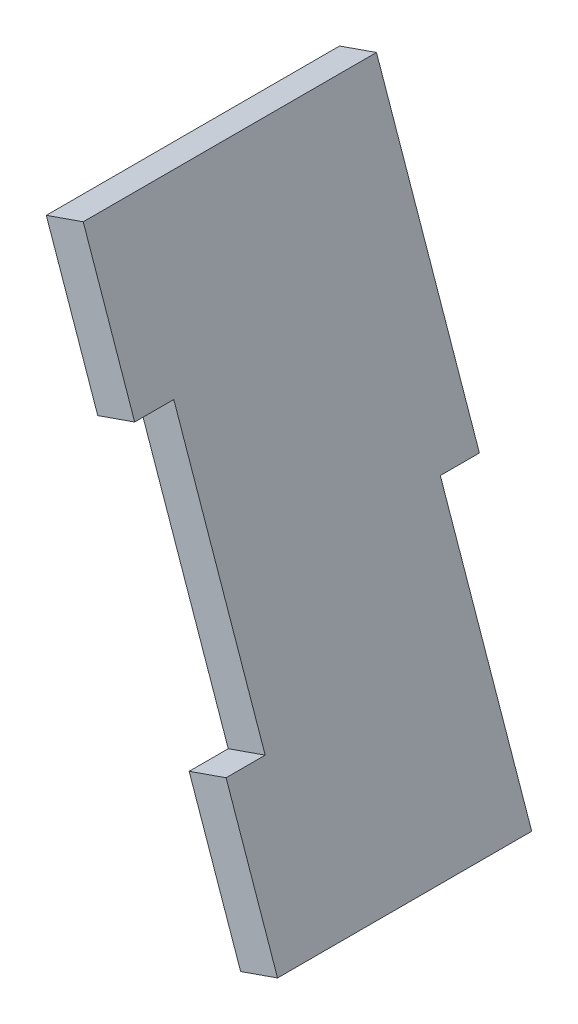
ISO-10303-21;
HEADER;
FILE_DESCRIPTION(('STEP AP214'),'2;1');
FILE_NAME('part.step','',(''),(''),'','','');
FILE_SCHEMA(('AUTOMOTIVE_DESIGN { 1 0 10303 214 1 1 1 1 }'));
ENDSEC;
DATA;
#1=APPLICATION_CONTEXT('core data for automotive mechanical design processes');
#2=APPLICATION_PROTOCOL_DEFINITION('international standard','automotive_design',2000,#1);
#3=PRODUCT_CONTEXT('',#1,'mechanical');
#4=PRODUCT('Part','Part','',(#3));
#5=PRODUCT_RELATED_PRODUCT_CATEGORY('part','',(#4));
#6=PRODUCT_DEFINITION_FORMATION('','',#4);
#7=PRODUCT_DEFINITION_CONTEXT('part definition',#1,'design');
#8=PRODUCT_DEFINITION('design','',#6,#7);
#9=PRODUCT_DEFINITION_SHAPE('','',#8);
#10=(LENGTH_UNIT() NAMED_UNIT(*) SI_UNIT(.MILLI.,.METRE.));
#11=(NAMED_UNIT(*) PLANE_ANGLE_UNIT() SI_UNIT($,.RADIAN.));
#12=(NAMED_UNIT(*) SI_UNIT($,.STERADIAN.) SOLID_ANGLE_UNIT());
#13=UNCERTAINTY_MEASURE_WITH_UNIT(LENGTH_MEASURE(1.E-05),#10,'distance_accuracy_value','');
#14=(GEOMETRIC_REPRESENTATION_CONTEXT(3) GLOBAL_UNCERTAINTY_ASSIGNED_CONTEXT((#13)) GLOBAL_UNIT_ASSIGNED_CONTEXT((#10,
#11,#12)) REPRESENTATION_CONTEXT('',''));
#15=CARTESIAN_POINT('',(0.,0.,0.));
#16=DIRECTION('',(0.,0.,1.));
#17=DIRECTION('',(1.,0.,0.));
#18=AXIS2_PLACEMENT_3D('',#15,#16,#17);
#19=CARTESIAN_POINT('',(-432.710213037798,335.493380268932,-23.8125));
#20=DIRECTION('',(0.,0.,1.));
#21=DIRECTION('',(0.999997615388015,0.00218385399765031,0.));
#22=AXIS2_PLACEMENT_3D('',#19,#20,#21);
#23=PLANE('',#22);
#24=DIRECTION('',(-0.944323729935791,-0.329017770158626,0.));
#25=VECTOR('',#24,1.);
#26=CARTESIAN_POINT('',(-314.308797668532,291.402504239534,-23.8124999999998));
#27=LINE('',#26,#25);
#28=CARTESIAN_POINT('',(-314.308797668532,291.402504239535,-23.8124999999998));
#29=VERTEX_POINT('',#28);
#30=CARTESIAN_POINT('',(-317.307025511078,290.357872819281,-23.8125));
#31=VERTEX_POINT('',#30);
#32=EDGE_CURVE('E120',#29,#31,#27,.T.);
#33=ORIENTED_EDGE('',*,*,#32,.T.);
#34=DIRECTION('',(0.329017770158626,-0.944323729935791,0.));
#35=VECTOR('',#34,1.);
#36=CARTESIAN_POINT('',(-309.885267674268,269.056463962983,-23.8125));
#37=LINE('',#36,#35);
#38=CARTESIAN_POINT('',(-325.664076873107,314.343695559649,-23.8125));
#39=VERTEX_POINT('',#38);
#40=EDGE_CURVE('E37',#39,#31,#37,.T.);
#41=ORIENTED_EDGE('',*,*,#40,.F.);
#42=DIRECTION('',(-0.944323729935799,-0.329017770158605,0.));
#43=VECTOR('',#42,1.);
#44=CARTESIAN_POINT('',(-325.664076873107,314.343695559649,-23.8125));
#45=LINE('',#44,#43);
#46=CARTESIAN_POINT('',(-322.665849030561,315.388326979903,-23.8125));
#47=VERTEX_POINT('',#46);
#48=EDGE_CURVE('E11',#47,#39,#45,.T.);
#49=ORIENTED_EDGE('',*,*,#48,.F.);
#50=DIRECTION('',(-0.329017770158627,0.944323729935791,0.));
#51=VECTOR('',#50,1.);
#52=CARTESIAN_POINT('',(-322.665849030561,315.388326979903,-23.8125));
#53=LINE('',#52,#51);
#54=EDGE_CURVE('E42',#29,#47,#53,.T.);
#55=ORIENTED_EDGE('',*,*,#54,.F.);
#56=EDGE_LOOP('',(#33,#41,#49,#55));
#57=FACE_BOUND('',#56,.T.);
#58=ADVANCED_FACE('F33',(#57),#23,.F.);
#59=CARTESIAN_POINT('',(0.,0.,0.));
#60=DIRECTION('',(0.,0.,-1.));
#61=DIRECTION('',(-1.,0.,0.));
#62=AXIS2_PLACEMENT_3D('',#59,#60,#61);
#63=PLANE('',#62);
#64=DIRECTION('',(0.329017770158627,-0.944323729935791,0.));
#65=VECTOR('',#64,1.);
#66=CARTESIAN_POINT('',(-322.665849030561,315.388326979903,0.));
#67=LINE('',#66,#65);
#68=CARTESIAN_POINT('',(-311.065565512737,282.094006753421,0.));
#69=VERTEX_POINT('',#68);
#70=CARTESIAN_POINT('',(-306.887039831722,270.101095383237,0.));
#71=VERTEX_POINT('',#70);
#72=EDGE_CURVE('E163',#69,#71,#67,.T.);
#73=ORIENTED_EDGE('',*,*,#72,.F.);
#74=DIRECTION('',(-0.944323729935791,-0.329017770158627,0.));
#75=VECTOR('',#74,1.);
#76=CARTESIAN_POINT('',(-311.065565512737,282.094006753421,0.));
#77=LINE('',#76,#75);
#78=CARTESIAN_POINT('',(-314.063793355283,281.049375333168,0.));
#79=VERTEX_POINT('',#78);
#80=EDGE_CURVE('E151',#69,#79,#77,.T.);
#81=ORIENTED_EDGE('',*,*,#80,.T.);
#82=DIRECTION('',(-0.329017770158626,0.944323729935791,0.));
#83=VECTOR('',#82,1.);
#84=CARTESIAN_POINT('',(-309.885267674268,269.056463962983,0.));
#85=LINE('',#84,#83);
#86=CARTESIAN_POINT('',(-309.885267674268,269.056463962983,0.));
#87=VERTEX_POINT('',#86);
#88=EDGE_CURVE('E171',#87,#79,#85,.T.);
#89=ORIENTED_EDGE('',*,*,#88,.F.);
#90=DIRECTION('',(-0.944323729935793,-0.329017770158621,0.));
#91=VECTOR('',#90,1.);
#92=CARTESIAN_POINT('',(-306.887039831722,270.101095383237,0.));
#93=LINE('',#92,#91);
#94=EDGE_CURVE('E167',#71,#87,#93,.T.);
#95=ORIENTED_EDGE('',*,*,#94,.F.);
#96=EDGE_LOOP('',(#73,#81,#89,#95));
#97=FACE_BOUND('',#96,.T.);
#98=ADVANCED_FACE('F207',(#97),#63,.F.);
#99=CARTESIAN_POINT('',(-321.485551192092,302.350784189465,0.));
#100=VERTEX_POINT('',#99);
#101=CARTESIAN_POINT('',(-325.664076873107,314.343695559649,0.));
#102=VERTEX_POINT('',#101);
#103=EDGE_CURVE('E170',#100,#102,#85,.T.);
#104=ORIENTED_EDGE('',*,*,#103,.F.);
#105=DIRECTION('',(-0.944323729935791,-0.329017770158627,0.));
#106=VECTOR('',#105,1.);
#107=CARTESIAN_POINT('',(-318.487323349546,303.395415609719,0.));
#108=LINE('',#107,#106);
#109=CARTESIAN_POINT('',(-318.487323349546,303.395415609719,0.));
#110=VERTEX_POINT('',#109);
#111=EDGE_CURVE('E149',#110,#100,#108,.T.);
#112=ORIENTED_EDGE('',*,*,#111,.F.);
#113=CARTESIAN_POINT('',(-322.665849030561,315.388326979903,0.));
#114=VERTEX_POINT('',#113);
#115=EDGE_CURVE('E164',#114,#110,#67,.T.);
#116=ORIENTED_EDGE('',*,*,#115,.F.);
#117=DIRECTION('',(0.944323729935799,0.329017770158605,0.));
#118=VECTOR('',#117,1.);
#119=CARTESIAN_POINT('',(-325.664076873107,314.343695559649,0.));
#120=LINE('',#119,#118);
#121=EDGE_CURVE('E159',#102,#114,#120,.T.);
#122=ORIENTED_EDGE('',*,*,#121,.F.);
#123=EDGE_LOOP('',(#104,#112,#116,#122));
#124=FACE_BOUND('',#123,.T.);
#125=ADVANCED_FACE('F192',(#124),#63,.F.);
#126=CARTESIAN_POINT('',(-309.885267674268,269.056463962983,-73.8046858961193));
#127=DIRECTION('',(0.944323729935791,0.329017770158626,0.));
#128=DIRECTION('',(-0.329017770158626,0.944323729935791,0.));
#129=AXIS2_PLACEMENT_3D('',#126,#127,#128);
#130=PLANE('',#129);
#131=DIRECTION('',(0.,0.,1.));
#132=VECTOR('',#131,1.);
#133=CARTESIAN_POINT('',(-317.307025511078,290.35787281928,-20.6375));
#134=LINE('',#133,#132);
#135=CARTESIAN_POINT('',(-317.307025511078,290.35787281928,-20.6375));
#136=VERTEX_POINT('',#135);
#137=EDGE_CURVE('E50',#31,#136,#134,.T.);
#138=ORIENTED_EDGE('',*,*,#137,.T.);
#139=DIRECTION('',(-0.329017770158626,0.944323729935792,0.));
#140=VECTOR('',#139,1.);
#141=CARTESIAN_POINT('',(-309.885267674268,269.056463962983,-20.6375));
#142=LINE('',#141,#140);
#143=CARTESIAN_POINT('',(-309.885267674268,269.056463962983,-20.6375));
#144=VERTEX_POINT('',#143);
#145=EDGE_CURVE('E118',#144,#136,#142,.T.);
#146=ORIENTED_EDGE('',*,*,#145,.F.);
#147=DIRECTION('',(0.,0.,1.));
#148=VECTOR('',#147,1.);
#149=CARTESIAN_POINT('',(-309.885267674268,269.056463962983,-73.8046858961193));
#150=LINE('',#149,#148);
#151=EDGE_CURVE('E176',#144,#87,#150,.T.);
#152=ORIENTED_EDGE('',*,*,#151,.T.);
#153=ORIENTED_EDGE('',*,*,#88,.T.);
#154=DIRECTION('',(0.,0.,1.));
#155=VECTOR('',#154,1.);
#156=CARTESIAN_POINT('',(-314.063793355283,281.049375333168,-3.17500000000004));
#157=LINE('',#156,#155);
#158=CARTESIAN_POINT('',(-314.063793355283,281.049375333168,-3.175));
#159=VERTEX_POINT('',#158);
#160=EDGE_CURVE('E132',#159,#79,#157,.T.);
#161=ORIENTED_EDGE('',*,*,#160,.F.);
#162=DIRECTION('',(0.329017770158626,-0.944323729935791,0.));
#163=VECTOR('',#162,1.);
#164=CARTESIAN_POINT('',(-309.885267674268,269.056463962983,-3.175));
#165=LINE('',#164,#163);
#166=CARTESIAN_POINT('',(-321.485551192092,302.350784189465,-3.17500000000004));
#167=VERTEX_POINT('',#166);
#168=EDGE_CURVE('E157',#167,#159,#165,.T.);
#169=ORIENTED_EDGE('',*,*,#168,.F.);
#170=DIRECTION('',(0.,0.,-1.));
#171=VECTOR('',#170,1.);
#172=CARTESIAN_POINT('',(-321.485551192092,302.350784189465,-3.17500000000004));
#173=LINE('',#172,#171);
#174=EDGE_CURVE('E134',#100,#167,#173,.T.);
#175=ORIENTED_EDGE('',*,*,#174,.F.);
#176=ORIENTED_EDGE('',*,*,#103,.T.);
#177=DIRECTION('',(0.,0.,1.));
#178=VECTOR('',#177,1.);
#179=CARTESIAN_POINT('',(-325.664076873107,314.343695559649,-73.8046858961193));
#180=LINE('',#179,#178);
#181=EDGE_CURVE('E174',#39,#102,#180,.T.);
#182=ORIENTED_EDGE('',*,*,#181,.F.);
#183=ORIENTED_EDGE('',*,*,#40,.T.);
#184=EDGE_LOOP('',(#138,#146,#152,#153,#161,#169,#175,#176,#182,#183));
#185=FACE_BOUND('',#184,.T.);
#186=ADVANCED_FACE('F184',(#185),#130,.F.);
#187=CARTESIAN_POINT('',(-306.887039831722,270.101095383237,-73.8046858961193));
#188=DIRECTION('',(-0.329017770158621,0.944323729935793,0.));
#189=DIRECTION('',(-0.944323729935793,-0.329017770158621,0.));
#190=AXIS2_PLACEMENT_3D('',#187,#188,#189);
#191=PLANE('',#190);
#192=ORIENTED_EDGE('',*,*,#151,.F.);
#193=DIRECTION('',(0.944323729935789,0.329017770158633,0.));
#194=VECTOR('',#193,1.);
#195=CARTESIAN_POINT('',(-309.885267674268,269.056463962983,-20.6375));
#196=LINE('',#195,#194);
#197=CARTESIAN_POINT('',(-306.887039831722,270.101095383237,-20.6375));
#198=VERTEX_POINT('',#197);
#199=EDGE_CURVE('E119',#144,#198,#196,.T.);
#200=ORIENTED_EDGE('',*,*,#199,.T.);
#201=DIRECTION('',(0.,0.,1.));
#202=VECTOR('',#201,1.);
#203=CARTESIAN_POINT('',(-306.887039831722,270.101095383237,-73.8046858961193));
#204=LINE('',#203,#202);
#205=EDGE_CURVE('E131',#198,#71,#204,.T.);
#206=ORIENTED_EDGE('',*,*,#205,.T.);
#207=ORIENTED_EDGE('',*,*,#94,.T.);
#208=EDGE_LOOP('',(#192,#200,#206,#207));
#209=FACE_BOUND('',#208,.T.);
#210=ADVANCED_FACE('F211',(#209),#191,.F.);
#211=CARTESIAN_POINT('',(-322.665849030561,315.388326979903,-73.8046858961193));
#212=DIRECTION('',(-0.944323729935791,-0.329017770158627,0.));
#213=DIRECTION('',(0.329017770158627,-0.944323729935791,0.));
#214=AXIS2_PLACEMENT_3D('',#211,#212,#213);
#215=PLANE('',#214);
#216=ORIENTED_EDGE('',*,*,#205,.F.);
#217=DIRECTION('',(0.329017770158627,-0.944323729935791,0.));
#218=VECTOR('',#217,1.);
#219=CARTESIAN_POINT('',(-322.665849030561,315.388326979903,-20.6375));
#220=LINE('',#219,#218);
#221=CARTESIAN_POINT('',(-314.308797668532,291.402504239534,-20.6375));
#222=VERTEX_POINT('',#221);
#223=EDGE_CURVE('E115',#222,#198,#220,.T.);
#224=ORIENTED_EDGE('',*,*,#223,.F.);
#225=DIRECTION('',(0.,0.,1.));
#226=VECTOR('',#225,1.);
#227=CARTESIAN_POINT('',(-314.308797668532,291.402504239534,-20.6375));
#228=LINE('',#227,#226);
#229=EDGE_CURVE('E123',#29,#222,#228,.T.);
#230=ORIENTED_EDGE('',*,*,#229,.F.);
#231=ORIENTED_EDGE('',*,*,#54,.T.);
#232=DIRECTION('',(0.,0.,1.));
#233=VECTOR('',#232,1.);
#234=CARTESIAN_POINT('',(-322.665849030561,315.388326979903,-73.8046858961193));
#235=LINE('',#234,#233);
#236=EDGE_CURVE('E178',#47,#114,#235,.T.);
#237=ORIENTED_EDGE('',*,*,#236,.T.);
#238=ORIENTED_EDGE('',*,*,#115,.T.);
#239=DIRECTION('',(0.,0.,-1.));
#240=VECTOR('',#239,1.);
#241=CARTESIAN_POINT('',(-318.487323349546,303.395415609719,-3.17500000000004));
#242=LINE('',#241,#240);
#243=CARTESIAN_POINT('',(-318.487323349546,303.395415609719,-3.17500000000004));
#244=VERTEX_POINT('',#243);
#245=EDGE_CURVE('E142',#110,#244,#242,.T.);
#246=ORIENTED_EDGE('',*,*,#245,.T.);
#247=DIRECTION('',(-0.329017770158627,0.944323729935791,0.));
#248=VECTOR('',#247,1.);
#249=CARTESIAN_POINT('',(-322.665849030561,315.388326979903,-3.175));
#250=LINE('',#249,#248);
#251=CARTESIAN_POINT('',(-311.065565512737,282.094006753421,-3.17500000000004));
#252=VERTEX_POINT('',#251);
#253=EDGE_CURVE('E148',#252,#244,#250,.T.);
#254=ORIENTED_EDGE('',*,*,#253,.F.);
#255=DIRECTION('',(0.,0.,1.));
#256=VECTOR('',#255,1.);
#257=CARTESIAN_POINT('',(-311.065565512737,282.094006753421,-3.17500000000004));
#258=LINE('',#257,#256);
#259=EDGE_CURVE('E139',#252,#69,#258,.T.);
#260=ORIENTED_EDGE('',*,*,#259,.T.);
#261=ORIENTED_EDGE('',*,*,#72,.T.);
#262=EDGE_LOOP('',(#216,#224,#230,#231,#237,#238,#246,#254,#260,#261));
#263=FACE_BOUND('',#262,.T.);
#264=ADVANCED_FACE('F129',(#263),#215,.F.);
#265=CARTESIAN_POINT('',(-325.664076873107,314.343695559649,-73.8046858961193));
#266=DIRECTION('',(0.329017770158605,-0.944323729935799,0.));
#267=DIRECTION('',(0.944323729935799,0.329017770158605,0.));
#268=AXIS2_PLACEMENT_3D('',#265,#266,#267);
#269=PLANE('',#268);
#270=ORIENTED_EDGE('',*,*,#121,.T.);
#271=ORIENTED_EDGE('',*,*,#236,.F.);
#272=ORIENTED_EDGE('',*,*,#48,.T.);
#273=ORIENTED_EDGE('',*,*,#181,.T.);
#274=EDGE_LOOP('',(#270,#271,#272,#273));
#275=FACE_BOUND('',#274,.T.);
#276=ADVANCED_FACE('F35',(#275),#269,.F.);
#277=CARTESIAN_POINT('',(-434.415204139327,321.633982667292,-3.175));
#278=DIRECTION('',(0.,0.,1.));
#279=DIRECTION('',(1.,0.,0.));
#280=AXIS2_PLACEMENT_3D('',#277,#278,#279);
#281=PLANE('',#280);
#282=ORIENTED_EDGE('',*,*,#168,.T.);
#283=DIRECTION('',(-0.944323729935791,-0.329017770158627,0.));
#284=VECTOR('',#283,1.);
#285=CARTESIAN_POINT('',(-311.065565512737,282.094006753421,-3.17500000000004));
#286=LINE('',#285,#284);
#287=EDGE_CURVE('E144',#252,#159,#286,.T.);
#288=ORIENTED_EDGE('',*,*,#287,.F.);
#289=ORIENTED_EDGE('',*,*,#253,.T.);
#290=DIRECTION('',(-0.944323729935791,-0.329017770158627,0.));
#291=VECTOR('',#290,1.);
#292=CARTESIAN_POINT('',(-318.487323349546,303.395415609719,-3.17500000000004));
#293=LINE('',#292,#291);
#294=EDGE_CURVE('E58',#244,#167,#293,.T.);
#295=ORIENTED_EDGE('',*,*,#294,.T.);
#296=EDGE_LOOP('',(#282,#288,#289,#295));
#297=FACE_BOUND('',#296,.T.);
#298=ADVANCED_FACE('F201',(#297),#281,.T.);
#299=CARTESIAN_POINT('',(-311.065565512737,282.094006753421,-3.17500000000004));
#300=DIRECTION('',(0.329017770158627,-0.944323729935791,0.));
#301=DIRECTION('',(-0.944323729935791,-0.329017770158627,0.));
#302=AXIS2_PLACEMENT_3D('',#299,#300,#301);
#303=PLANE('',#302);
#304=ORIENTED_EDGE('',*,*,#160,.T.);
#305=ORIENTED_EDGE('',*,*,#80,.F.);
#306=ORIENTED_EDGE('',*,*,#259,.F.);
#307=ORIENTED_EDGE('',*,*,#287,.T.);
#308=EDGE_LOOP('',(#304,#305,#306,#307));
#309=FACE_BOUND('',#308,.T.);
#310=ADVANCED_FACE('F203',(#309),#303,.F.);
#311=CARTESIAN_POINT('',(-318.487323349546,303.395415609719,-3.17500000000004));
#312=DIRECTION('',(-0.329017770158627,0.944323729935791,0.));
#313=DIRECTION('',(0.944323729935791,0.329017770158627,0.));
#314=AXIS2_PLACEMENT_3D('',#311,#312,#313);
#315=PLANE('',#314);
#316=ORIENTED_EDGE('',*,*,#174,.T.);
#317=ORIENTED_EDGE('',*,*,#294,.F.);
#318=ORIENTED_EDGE('',*,*,#245,.F.);
#319=ORIENTED_EDGE('',*,*,#111,.T.);
#320=EDGE_LOOP('',(#316,#317,#318,#319));
#321=FACE_BOUND('',#320,.T.);
#322=ADVANCED_FACE('F195',(#321),#315,.F.);
#323=CARTESIAN_POINT('',(-432.710213037798,335.49338026893,-20.6375));
#324=DIRECTION('',(0.,0.,1.));
#325=DIRECTION('',(0.999997615388015,0.00218385399765034,0.));
#326=AXIS2_PLACEMENT_3D('',#323,#324,#325);
#327=PLANE('',#326);
#328=DIRECTION('',(-0.944323729935791,-0.329017770158626,0.));
#329=VECTOR('',#328,1.);
#330=CARTESIAN_POINT('',(-314.308797668532,291.402504239534,-20.6375));
#331=LINE('',#330,#329);
#332=EDGE_CURVE('E111',#222,#136,#331,.T.);
#333=ORIENTED_EDGE('',*,*,#332,.F.);
#334=ORIENTED_EDGE('',*,*,#223,.T.);
#335=ORIENTED_EDGE('',*,*,#199,.F.);
#336=ORIENTED_EDGE('',*,*,#145,.T.);
#337=EDGE_LOOP('',(#333,#334,#335,#336));
#338=FACE_BOUND('',#337,.T.);
#339=ADVANCED_FACE('F113',(#338),#327,.F.);
#340=CARTESIAN_POINT('',(-314.308797668532,291.402504239534,-20.6375));
#341=DIRECTION('',(0.329017770158626,-0.944323729935791,0.));
#342=DIRECTION('',(-0.944323729935791,-0.329017770158626,0.));
#343=AXIS2_PLACEMENT_3D('',#340,#341,#342);
#344=PLANE('',#343);
#345=ORIENTED_EDGE('',*,*,#137,.F.);
#346=ORIENTED_EDGE('',*,*,#32,.F.);
#347=ORIENTED_EDGE('',*,*,#229,.T.);
#348=ORIENTED_EDGE('',*,*,#332,.T.);
#349=EDGE_LOOP('',(#345,#346,#347,#348));
#350=FACE_BOUND('',#349,.T.);
#351=ADVANCED_FACE('F124',(#350),#344,.T.);
#352=CLOSED_SHELL('',(#58,#98,#125,#186,#210,#264,#276,#298,#310,#322,#339,#351));
#353=MANIFOLD_SOLID_BREP('B2',#352);
#354=ADVANCED_BREP_SHAPE_REPRESENTATION('',(#18,#353),#14);
#355=SHAPE_DEFINITION_REPRESENTATION(#9,#354);
ENDSEC;
END-ISO-10303-21;
